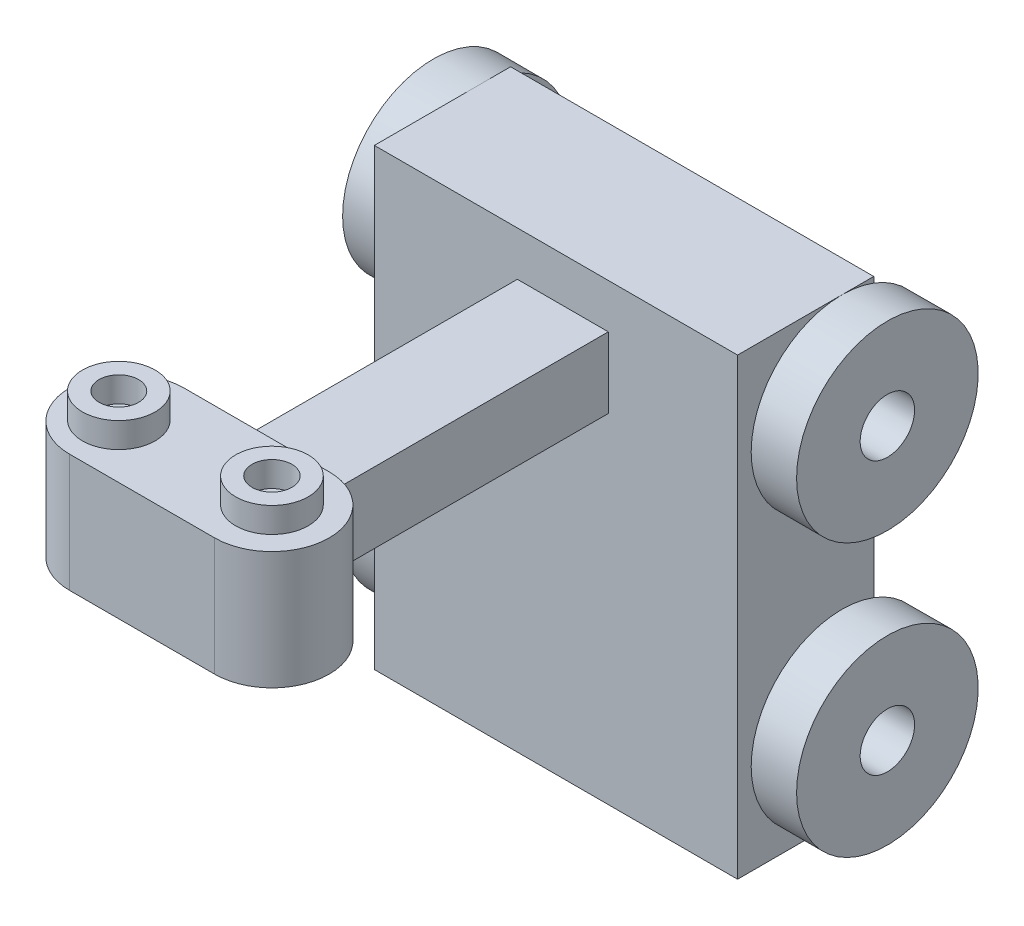
ISO-10303-21;
HEADER;
FILE_DESCRIPTION(('STEP AP214'),'2;1');
FILE_NAME('part.step','',(''),(''),'','','');
FILE_SCHEMA(('AUTOMOTIVE_DESIGN { 1 0 10303 214 1 1 1 1 }'));
ENDSEC;
DATA;
#1=APPLICATION_CONTEXT('core data for automotive mechanical design processes');
#2=APPLICATION_PROTOCOL_DEFINITION('international standard','automotive_design',2000,#1);
#3=PRODUCT_CONTEXT('',#1,'mechanical');
#4=PRODUCT('Part','Part','',(#3));
#5=PRODUCT_RELATED_PRODUCT_CATEGORY('part','',(#4));
#6=PRODUCT_DEFINITION_FORMATION('','',#4);
#7=PRODUCT_DEFINITION_CONTEXT('part definition',#1,'design');
#8=PRODUCT_DEFINITION('design','',#6,#7);
#9=PRODUCT_DEFINITION_SHAPE('','',#8);
#10=(LENGTH_UNIT() NAMED_UNIT(*) SI_UNIT(.MILLI.,.METRE.));
#11=(NAMED_UNIT(*) PLANE_ANGLE_UNIT() SI_UNIT($,.RADIAN.));
#12=(NAMED_UNIT(*) SI_UNIT($,.STERADIAN.) SOLID_ANGLE_UNIT());
#13=UNCERTAINTY_MEASURE_WITH_UNIT(LENGTH_MEASURE(1.E-05),#10,'distance_accuracy_value','');
#14=(GEOMETRIC_REPRESENTATION_CONTEXT(3) GLOBAL_UNCERTAINTY_ASSIGNED_CONTEXT((#13)) GLOBAL_UNIT_ASSIGNED_CONTEXT((#10,
#11,#12)) REPRESENTATION_CONTEXT('',''));
#15=CARTESIAN_POINT('',(0.,0.,0.));
#16=DIRECTION('',(0.,0.,1.));
#17=DIRECTION('',(1.,0.,0.));
#18=AXIS2_PLACEMENT_3D('',#15,#16,#17);
#19=CARTESIAN_POINT('',(0.,0.,1500.));
#20=DIRECTION('',(0.,0.,-1.));
#21=DIRECTION('',(-1.,0.,0.));
#22=AXIS2_PLACEMENT_3D('',#19,#20,#21);
#23=PLANE('',#22);
#24=DIRECTION('',(1.,0.,0.));
#25=VECTOR('',#24,1.);
#26=CARTESIAN_POINT('',(36898.7914533631,-2706.1111285181,1500.));
#27=LINE('',#26,#25);
#28=CARTESIAN_POINT('',(36898.7914533631,-2706.1111285181,1500.));
#29=VERTEX_POINT('',#28);
#30=CARTESIAN_POINT('',(40898.7914533631,-2706.1111285181,1500.));
#31=VERTEX_POINT('',#30);
#32=EDGE_CURVE('E340',#29,#31,#27,.T.);
#33=ORIENTED_EDGE('',*,*,#32,.T.);
#34=DIRECTION('',(0.,-1.,0.));
#35=VECTOR('',#34,1.);
#36=CARTESIAN_POINT('',(40898.7914533631,2293.8888714819,1500.));
#37=LINE('',#36,#35);
#38=CARTESIAN_POINT('',(40898.7914533631,2293.8888714819,1500.));
#39=VERTEX_POINT('',#38);
#40=EDGE_CURVE('E343',#39,#31,#37,.T.);
#41=ORIENTED_EDGE('',*,*,#40,.F.);
#42=DIRECTION('',(1.,0.,0.));
#43=VECTOR('',#42,1.);
#44=CARTESIAN_POINT('',(36898.7914533631,2293.8888714819,1500.));
#45=LINE('',#44,#43);
#46=CARTESIAN_POINT('',(36898.7914533631,2293.8888714819,1500.));
#47=VERTEX_POINT('',#46);
#48=EDGE_CURVE('E348',#47,#39,#45,.T.);
#49=ORIENTED_EDGE('',*,*,#48,.F.);
#50=DIRECTION('',(0.,-1.,0.));
#51=VECTOR('',#50,1.);
#52=CARTESIAN_POINT('',(36898.7914533631,2293.8888714819,1500.));
#53=LINE('',#52,#51);
#54=EDGE_CURVE('E352',#47,#29,#53,.T.);
#55=ORIENTED_EDGE('',*,*,#54,.T.);
#56=EDGE_LOOP('',(#33,#41,#49,#55));
#57=FACE_BOUND('',#56,.T.);
#58=DIRECTION('',(0.,-1.,0.));
#59=VECTOR('',#58,1.);
#60=CARTESIAN_POINT('',(38473.4254742559,1803.91212904851,1500.));
#61=LINE('',#60,#59);
#62=CARTESIAN_POINT('',(38473.4254742559,1803.91212904851,1500.));
#63=VERTEX_POINT('',#62);
#64=CARTESIAN_POINT('',(38473.4254742559,1024.7967765164,1500.));
#65=VERTEX_POINT('',#64);
#66=EDGE_CURVE('E242',#63,#65,#61,.T.);
#67=ORIENTED_EDGE('',*,*,#66,.F.);
#68=DIRECTION('',(-1.,0.,0.));
#69=VECTOR('',#68,1.);
#70=CARTESIAN_POINT('',(38473.4254742559,1803.91212904851,1500.));
#71=LINE('',#70,#69);
#72=CARTESIAN_POINT('',(39475.1452132258,1803.91212904851,1500.));
#73=VERTEX_POINT('',#72);
#74=EDGE_CURVE('E253',#73,#63,#71,.T.);
#75=ORIENTED_EDGE('',*,*,#74,.F.);
#76=DIRECTION('',(0.,1.,0.));
#77=VECTOR('',#76,1.);
#78=CARTESIAN_POINT('',(39475.1452132258,1803.91212904851,1500.));
#79=LINE('',#78,#77);
#80=CARTESIAN_POINT('',(39475.1452132258,1024.7967765164,1500.));
#81=VERTEX_POINT('',#80);
#82=EDGE_CURVE('E249',#81,#73,#79,.T.);
#83=ORIENTED_EDGE('',*,*,#82,.F.);
#84=DIRECTION('',(1.,0.,0.));
#85=VECTOR('',#84,1.);
#86=CARTESIAN_POINT('',(38473.4254742559,1024.7967765164,1500.));
#87=LINE('',#86,#85);
#88=EDGE_CURVE('E246',#65,#81,#87,.T.);
#89=ORIENTED_EDGE('',*,*,#88,.F.);
#90=EDGE_LOOP('',(#67,#75,#83,#89));
#91=FACE_BOUND('',#90,.T.);
#92=ADVANCED_FACE('F45',(#57,#91),#23,.F.);
#93=CARTESIAN_POINT('',(41398.7914533631,1293.8888714819,350.));
#94=DIRECTION('',(-1.,0.,0.));
#95=DIRECTION('',(0.,0.,1.));
#96=AXIS2_PLACEMENT_3D('',#93,#94,#95);
#97=CYLINDRICAL_SURFACE('',#96,1000.);
#98=CARTESIAN_POINT('',(41398.7914533631,1293.8888714819,350.));
#99=DIRECTION('',(-1.,0.,0.));
#100=DIRECTION('',(0.,0.,1.));
#101=AXIS2_PLACEMENT_3D('',#98,#99,#100);
#102=CIRCLE('',#101,1000.);
#103=CARTESIAN_POINT('',(41398.7914533631,1293.8888714819,1350.));
#104=VERTEX_POINT('',#103);
#105=EDGE_CURVE('E322',#104,#104,#102,.T.);
#106=ORIENTED_EDGE('',*,*,#105,.T.);
#107=EDGE_LOOP('',(#106));
#108=FACE_BOUND('',#107,.T.);
#109=CARTESIAN_POINT('',(40898.7914533631,1293.8888714819,350.));
#110=DIRECTION('',(1.,0.,0.));
#111=DIRECTION('',(0.,0.,-1.));
#112=AXIS2_PLACEMENT_3D('',#109,#110,#111);
#113=CIRCLE('',#112,1000.);
#114=CARTESIAN_POINT('',(40898.7914533631,2293.8888714819,350.));
#115=VERTEX_POINT('',#114);
#116=CARTESIAN_POINT('',(40898.7914533631,357.139171722141,0.));
#117=VERTEX_POINT('',#116);
#118=EDGE_CURVE('E329',#115,#117,#113,.T.);
#119=ORIENTED_EDGE('',*,*,#118,.T.);
#120=CARTESIAN_POINT('',(40898.7914533631,1293.8888714819,350.));
#121=DIRECTION('',(-1.,0.,0.));
#122=DIRECTION('',(0.,0.,1.));
#123=AXIS2_PLACEMENT_3D('',#120,#121,#122);
#124=CIRCLE('',#123,1000.);
#125=CARTESIAN_POINT('',(40898.7914533631,2230.63857124166,0.));
#126=VERTEX_POINT('',#125);
#127=EDGE_CURVE('E281',#117,#126,#124,.F.);
#128=ORIENTED_EDGE('',*,*,#127,.T.);
#129=EDGE_CURVE('E334',#126,#115,#113,.T.);
#130=ORIENTED_EDGE('',*,*,#129,.T.);
#131=EDGE_LOOP('',(#119,#128,#130));
#132=FACE_BOUND('',#131,.T.);
#133=ADVANCED_FACE('F447',(#108,#132),#97,.T.);
#134=CARTESIAN_POINT('',(36398.7914533631,1293.8888714819,350.));
#135=DIRECTION('',(-1.,0.,0.));
#136=DIRECTION('',(0.,0.,1.));
#137=AXIS2_PLACEMENT_3D('',#134,#135,#136);
#138=CIRCLE('',#137,1000.);
#139=CARTESIAN_POINT('',(36398.7914533631,1293.8888714819,1350.));
#140=VERTEX_POINT('',#139);
#141=EDGE_CURVE('E314',#140,#140,#138,.T.);
#142=ORIENTED_EDGE('',*,*,#141,.F.);
#143=EDGE_LOOP('',(#142));
#144=FACE_BOUND('',#143,.T.);
#145=CARTESIAN_POINT('',(36898.7914533631,1293.8888714819,350.));
#146=DIRECTION('',(1.,0.,0.));
#147=DIRECTION('',(0.,0.,-1.));
#148=AXIS2_PLACEMENT_3D('',#145,#146,#147);
#149=CIRCLE('',#148,1000.);
#150=CARTESIAN_POINT('',(36898.7914533631,2230.63857124166,0.));
#151=VERTEX_POINT('',#150);
#152=CARTESIAN_POINT('',(36898.7914533631,2293.8888714819,350.));
#153=VERTEX_POINT('',#152);
#154=EDGE_CURVE('E326',#151,#153,#149,.T.);
#155=ORIENTED_EDGE('',*,*,#154,.F.);
#156=CARTESIAN_POINT('',(36898.7914533631,1293.8888714819,350.));
#157=DIRECTION('',(1.,0.,0.));
#158=DIRECTION('',(0.,0.,-1.));
#159=AXIS2_PLACEMENT_3D('',#156,#157,#158);
#160=CIRCLE('',#159,1000.);
#161=CARTESIAN_POINT('',(36898.7914533631,357.139171722141,0.));
#162=VERTEX_POINT('',#161);
#163=EDGE_CURVE('E277',#151,#162,#160,.F.);
#164=ORIENTED_EDGE('',*,*,#163,.T.);
#165=EDGE_CURVE('E330',#153,#162,#149,.T.);
#166=ORIENTED_EDGE('',*,*,#165,.F.);
#167=EDGE_LOOP('',(#155,#164,#166));
#168=FACE_BOUND('',#167,.T.);
#169=ADVANCED_FACE('F453',(#144,#168),#97,.T.);
#170=CARTESIAN_POINT('',(41398.7914533631,-1706.1111285181,350.));
#171=DIRECTION('',(-1.,0.,0.));
#172=DIRECTION('',(0.,0.,1.));
#173=AXIS2_PLACEMENT_3D('',#170,#171,#172);
#174=CYLINDRICAL_SURFACE('',#173,1000.);
#175=CARTESIAN_POINT('',(41398.7914533631,-1706.1111285181,350.));
#176=DIRECTION('',(-1.,0.,0.));
#177=DIRECTION('',(0.,0.,1.));
#178=AXIS2_PLACEMENT_3D('',#175,#176,#177);
#179=CIRCLE('',#178,1000.);
#180=CARTESIAN_POINT('',(41398.7914533631,-1706.1111285181,1350.));
#181=VERTEX_POINT('',#180);
#182=EDGE_CURVE('E297',#181,#181,#179,.T.);
#183=ORIENTED_EDGE('',*,*,#182,.T.);
#184=EDGE_LOOP('',(#183));
#185=FACE_BOUND('',#184,.T.);
#186=CARTESIAN_POINT('',(40898.7914533631,-1706.1111285181,350.));
#187=DIRECTION('',(1.,0.,0.));
#188=DIRECTION('',(0.,0.,-1.));
#189=AXIS2_PLACEMENT_3D('',#186,#187,#188);
#190=CIRCLE('',#189,1000.);
#191=CARTESIAN_POINT('',(40898.7914533631,-2706.1111285181,350.));
#192=VERTEX_POINT('',#191);
#193=CARTESIAN_POINT('',(40898.7914533631,-2642.86082827786,0.));
#194=VERTEX_POINT('',#193);
#195=EDGE_CURVE('E301',#192,#194,#190,.T.);
#196=ORIENTED_EDGE('',*,*,#195,.T.);
#197=CARTESIAN_POINT('',(40898.7914533631,-1706.1111285181,350.));
#198=DIRECTION('',(-1.,0.,0.));
#199=DIRECTION('',(0.,0.,1.));
#200=AXIS2_PLACEMENT_3D('',#197,#198,#199);
#201=CIRCLE('',#200,1000.);
#202=CARTESIAN_POINT('',(40898.7914533631,-769.361428758339,0.));
#203=VERTEX_POINT('',#202);
#204=EDGE_CURVE('E410',#194,#203,#201,.F.);
#205=ORIENTED_EDGE('',*,*,#204,.T.);
#206=EDGE_CURVE('E305',#203,#192,#190,.T.);
#207=ORIENTED_EDGE('',*,*,#206,.T.);
#208=EDGE_LOOP('',(#196,#205,#207));
#209=FACE_BOUND('',#208,.T.);
#210=ADVANCED_FACE('F518',(#185,#209),#174,.T.);
#211=CARTESIAN_POINT('',(36398.7914533631,-1706.1111285181,350.));
#212=DIRECTION('',(-1.,0.,0.));
#213=DIRECTION('',(0.,0.,1.));
#214=AXIS2_PLACEMENT_3D('',#211,#212,#213);
#215=CIRCLE('',#214,1000.);
#216=CARTESIAN_POINT('',(36398.7914533631,-1706.1111285181,1350.));
#217=VERTEX_POINT('',#216);
#218=EDGE_CURVE('E289',#217,#217,#215,.T.);
#219=ORIENTED_EDGE('',*,*,#218,.F.);
#220=EDGE_LOOP('',(#219));
#221=FACE_BOUND('',#220,.T.);
#222=CARTESIAN_POINT('',(36898.7914533631,-1706.1111285181,350.));
#223=DIRECTION('',(1.,0.,0.));
#224=DIRECTION('',(0.,0.,-1.));
#225=AXIS2_PLACEMENT_3D('',#222,#223,#224);
#226=CIRCLE('',#225,1000.);
#227=CARTESIAN_POINT('',(36898.7914533631,-769.361428758339,0.));
#228=VERTEX_POINT('',#227);
#229=CARTESIAN_POINT('',(36898.7914533631,-2706.1111285181,350.));
#230=VERTEX_POINT('',#229);
#231=EDGE_CURVE('E401',#228,#230,#226,.T.);
#232=ORIENTED_EDGE('',*,*,#231,.F.);
#233=CARTESIAN_POINT('',(36898.7914533631,-1706.1111285181,350.));
#234=DIRECTION('',(1.,0.,0.));
#235=DIRECTION('',(0.,0.,-1.));
#236=AXIS2_PLACEMENT_3D('',#233,#234,#235);
#237=CIRCLE('',#236,1000.);
#238=CARTESIAN_POINT('',(36898.7914533631,-2642.86082827786,0.));
#239=VERTEX_POINT('',#238);
#240=EDGE_CURVE('E406',#228,#239,#237,.F.);
#241=ORIENTED_EDGE('',*,*,#240,.T.);
#242=EDGE_CURVE('E397',#230,#239,#226,.T.);
#243=ORIENTED_EDGE('',*,*,#242,.F.);
#244=EDGE_LOOP('',(#232,#241,#243));
#245=FACE_BOUND('',#244,.T.);
#246=ADVANCED_FACE('F513',(#221,#245),#174,.T.);
#247=CARTESIAN_POINT('',(40898.7914533631,2293.8888714819,1500.));
#248=DIRECTION('',(1.,0.,0.));
#249=DIRECTION('',(0.,0.,-1.));
#250=AXIS2_PLACEMENT_3D('',#247,#248,#249);
#251=PLANE('',#250);
#252=ORIENTED_EDGE('',*,*,#206,.F.);
#253=DIRECTION('',(0.,-1.,0.));
#254=VECTOR('',#253,1.);
#255=CARTESIAN_POINT('',(40898.7914533631,2293.8888714819,0.));
#256=LINE('',#255,#254);
#257=EDGE_CURVE('E365',#117,#203,#256,.T.);
#258=ORIENTED_EDGE('',*,*,#257,.F.);
#259=ORIENTED_EDGE('',*,*,#118,.F.);
#260=DIRECTION('',(0.,0.,-1.));
#261=VECTOR('',#260,1.);
#262=CARTESIAN_POINT('',(40898.7914533631,2293.8888714819,1500.));
#263=LINE('',#262,#261);
#264=EDGE_CURVE('E384',#39,#115,#263,.T.);
#265=ORIENTED_EDGE('',*,*,#264,.F.);
#266=ORIENTED_EDGE('',*,*,#40,.T.);
#267=DIRECTION('',(0.,0.,-1.));
#268=VECTOR('',#267,1.);
#269=CARTESIAN_POINT('',(40898.7914533631,-2706.1111285181,1500.));
#270=LINE('',#269,#268);
#271=EDGE_CURVE('E389',#31,#192,#270,.T.);
#272=ORIENTED_EDGE('',*,*,#271,.T.);
#273=EDGE_LOOP('',(#252,#258,#259,#265,#266,#272));
#274=FACE_BOUND('',#273,.T.);
#275=ADVANCED_FACE('F487',(#274),#251,.T.);
#276=CARTESIAN_POINT('',(36898.7914533631,2293.8888714819,1500.));
#277=DIRECTION('',(1.,0.,0.));
#278=DIRECTION('',(0.,0.,-1.));
#279=AXIS2_PLACEMENT_3D('',#276,#277,#278);
#280=PLANE('',#279);
#281=DIRECTION('',(0.,-1.,0.));
#282=VECTOR('',#281,1.);
#283=CARTESIAN_POINT('',(36898.7914533631,2293.8888714819,0.));
#284=LINE('',#283,#282);
#285=EDGE_CURVE('E373',#162,#228,#284,.T.);
#286=ORIENTED_EDGE('',*,*,#285,.T.);
#287=ORIENTED_EDGE('',*,*,#231,.T.);
#288=DIRECTION('',(0.,0.,-1.));
#289=VECTOR('',#288,1.);
#290=CARTESIAN_POINT('',(36898.7914533631,-2706.1111285181,1500.));
#291=LINE('',#290,#289);
#292=EDGE_CURVE('E374',#29,#230,#291,.T.);
#293=ORIENTED_EDGE('',*,*,#292,.F.);
#294=ORIENTED_EDGE('',*,*,#54,.F.);
#295=DIRECTION('',(0.,0.,-1.));
#296=VECTOR('',#295,1.);
#297=CARTESIAN_POINT('',(36898.7914533631,2293.8888714819,1500.));
#298=LINE('',#297,#296);
#299=EDGE_CURVE('E379',#47,#153,#298,.T.);
#300=ORIENTED_EDGE('',*,*,#299,.T.);
#301=ORIENTED_EDGE('',*,*,#165,.T.);
#302=EDGE_LOOP('',(#286,#287,#293,#294,#300,#301));
#303=FACE_BOUND('',#302,.T.);
#304=ADVANCED_FACE('F489',(#303),#280,.F.);
#305=ORIENTED_EDGE('',*,*,#129,.F.);
#306=CARTESIAN_POINT('',(40898.7914533631,2293.8888714819,0.));
#307=VERTEX_POINT('',#306);
#308=EDGE_CURVE('E360',#307,#126,#256,.T.);
#309=ORIENTED_EDGE('',*,*,#308,.F.);
#310=EDGE_CURVE('E383',#115,#307,#263,.T.);
#311=ORIENTED_EDGE('',*,*,#310,.F.);
#312=EDGE_LOOP('',(#305,#309,#311));
#313=FACE_BOUND('',#312,.T.);
#314=ADVANCED_FACE('F478',(#313),#251,.T.);
#315=CARTESIAN_POINT('',(36898.7914533631,2293.8888714819,0.));
#316=VERTEX_POINT('',#315);
#317=EDGE_CURVE('E344',#316,#151,#284,.T.);
#318=ORIENTED_EDGE('',*,*,#317,.T.);
#319=ORIENTED_EDGE('',*,*,#154,.T.);
#320=EDGE_CURVE('E378',#153,#316,#298,.T.);
#321=ORIENTED_EDGE('',*,*,#320,.T.);
#322=EDGE_LOOP('',(#318,#319,#321));
#323=FACE_BOUND('',#322,.T.);
#324=ADVANCED_FACE('F471',(#323),#280,.F.);
#325=CARTESIAN_POINT('',(36898.7914533631,-2706.1111285181,1500.));
#326=DIRECTION('',(0.,1.,0.));
#327=DIRECTION('',(0.,0.,1.));
#328=AXIS2_PLACEMENT_3D('',#325,#326,#327);
#329=PLANE('',#328);
#330=CARTESIAN_POINT('',(40898.7914533631,-2706.1111285181,0.));
#331=VERTEX_POINT('',#330);
#332=EDGE_CURVE('E388',#192,#331,#270,.T.);
#333=ORIENTED_EDGE('',*,*,#332,.F.);
#334=ORIENTED_EDGE('',*,*,#271,.F.);
#335=ORIENTED_EDGE('',*,*,#32,.F.);
#336=ORIENTED_EDGE('',*,*,#292,.T.);
#337=CARTESIAN_POINT('',(36898.7914533631,-2706.1111285181,0.));
#338=VERTEX_POINT('',#337);
#339=EDGE_CURVE('E355',#230,#338,#291,.T.);
#340=ORIENTED_EDGE('',*,*,#339,.T.);
#341=DIRECTION('',(1.,0.,0.));
#342=VECTOR('',#341,1.);
#343=CARTESIAN_POINT('',(36898.7914533631,-2706.1111285181,0.));
#344=LINE('',#343,#342);
#345=EDGE_CURVE('E339',#338,#331,#344,.T.);
#346=ORIENTED_EDGE('',*,*,#345,.T.);
#347=EDGE_LOOP('',(#333,#334,#335,#336,#340,#346));
#348=FACE_BOUND('',#347,.T.);
#349=ADVANCED_FACE('F47',(#348),#329,.F.);
#350=ORIENTED_EDGE('',*,*,#195,.F.);
#351=ORIENTED_EDGE('',*,*,#332,.T.);
#352=EDGE_CURVE('E359',#194,#331,#256,.T.);
#353=ORIENTED_EDGE('',*,*,#352,.F.);
#354=EDGE_LOOP('',(#350,#351,#353));
#355=FACE_BOUND('',#354,.T.);
#356=ADVANCED_FACE('F473',(#355),#251,.T.);
#357=CARTESIAN_POINT('',(36898.7914533631,2293.8888714819,1500.));
#358=DIRECTION('',(0.,1.,0.));
#359=DIRECTION('',(0.,0.,1.));
#360=AXIS2_PLACEMENT_3D('',#357,#358,#359);
#361=PLANE('',#360);
#362=ORIENTED_EDGE('',*,*,#320,.F.);
#363=ORIENTED_EDGE('',*,*,#299,.F.);
#364=ORIENTED_EDGE('',*,*,#48,.T.);
#365=ORIENTED_EDGE('',*,*,#264,.T.);
#366=ORIENTED_EDGE('',*,*,#310,.T.);
#367=DIRECTION('',(1.,0.,0.));
#368=VECTOR('',#367,1.);
#369=CARTESIAN_POINT('',(36898.7914533631,2293.8888714819,0.));
#370=LINE('',#369,#368);
#371=EDGE_CURVE('E364',#316,#307,#370,.T.);
#372=ORIENTED_EDGE('',*,*,#371,.F.);
#373=EDGE_LOOP('',(#362,#363,#364,#365,#366,#372));
#374=FACE_BOUND('',#373,.T.);
#375=ADVANCED_FACE('F468',(#374),#361,.T.);
#376=ORIENTED_EDGE('',*,*,#339,.F.);
#377=ORIENTED_EDGE('',*,*,#242,.T.);
#378=EDGE_CURVE('E369',#239,#338,#284,.T.);
#379=ORIENTED_EDGE('',*,*,#378,.T.);
#380=EDGE_LOOP('',(#376,#377,#379));
#381=FACE_BOUND('',#380,.T.);
#382=ADVANCED_FACE('F464',(#381),#280,.F.);
#383=CARTESIAN_POINT('',(0.,0.,0.));
#384=DIRECTION('',(0.,0.,-1.));
#385=DIRECTION('',(-1.,0.,0.));
#386=AXIS2_PLACEMENT_3D('',#383,#384,#385);
#387=PLANE('',#386);
#388=ORIENTED_EDGE('',*,*,#308,.T.);
#389=DIRECTION('',(0.,-1.,0.));
#390=VECTOR('',#389,1.);
#391=CARTESIAN_POINT('',(40898.7914533631,2293.8888714819,0.));
#392=LINE('',#391,#390);
#393=EDGE_CURVE('E272',#126,#117,#392,.T.);
#394=ORIENTED_EDGE('',*,*,#393,.T.);
#395=ORIENTED_EDGE('',*,*,#257,.T.);
#396=EDGE_CURVE('E268',#203,#194,#392,.T.);
#397=ORIENTED_EDGE('',*,*,#396,.T.);
#398=ORIENTED_EDGE('',*,*,#352,.T.);
#399=ORIENTED_EDGE('',*,*,#345,.F.);
#400=ORIENTED_EDGE('',*,*,#378,.F.);
#401=DIRECTION('',(0.,1.,0.));
#402=VECTOR('',#401,1.);
#403=CARTESIAN_POINT('',(36898.7914533631,2293.8888714819,0.));
#404=LINE('',#403,#402);
#405=EDGE_CURVE('E276',#239,#228,#404,.T.);
#406=ORIENTED_EDGE('',*,*,#405,.T.);
#407=ORIENTED_EDGE('',*,*,#285,.F.);
#408=EDGE_CURVE('E273',#162,#151,#404,.T.);
#409=ORIENTED_EDGE('',*,*,#408,.T.);
#410=ORIENTED_EDGE('',*,*,#317,.F.);
#411=ORIENTED_EDGE('',*,*,#371,.T.);
#412=EDGE_LOOP('',(#388,#394,#395,#397,#398,#399,#400,#406,#407,#409,#410,#411));
#413=FACE_BOUND('',#412,.T.);
#414=ADVANCED_FACE('F460',(#413),#387,.T.);
#415=CARTESIAN_POINT('',(41398.7914533631,1293.8888714819,350.));
#416=DIRECTION('',(-1.,0.,0.));
#417=DIRECTION('',(0.,0.,1.));
#418=AXIS2_PLACEMENT_3D('',#415,#416,#417);
#419=CYLINDRICAL_SURFACE('',#418,300.);
#420=CARTESIAN_POINT('',(36398.7914533631,1293.8888714819,350.));
#421=DIRECTION('',(-1.,0.,0.));
#422=DIRECTION('',(0.,0.,1.));
#423=AXIS2_PLACEMENT_3D('',#420,#421,#422);
#424=CIRCLE('',#423,300.);
#425=CARTESIAN_POINT('',(36398.7914533631,1293.8888714819,650.));
#426=VERTEX_POINT('',#425);
#427=EDGE_CURVE('E310',#426,#426,#424,.T.);
#428=ORIENTED_EDGE('',*,*,#427,.T.);
#429=EDGE_LOOP('',(#428));
#430=FACE_BOUND('',#429,.T.);
#431=CARTESIAN_POINT('',(36898.7914533631,1293.8888714819,350.));
#432=DIRECTION('',(1.,0.,0.));
#433=DIRECTION('',(0.,0.,-1.));
#434=AXIS2_PLACEMENT_3D('',#431,#432,#433);
#435=CIRCLE('',#434,300.);
#436=CARTESIAN_POINT('',(36898.7914533631,1293.8888714819,50.));
#437=VERTEX_POINT('',#436);
#438=EDGE_CURVE('E393',#437,#437,#435,.T.);
#439=ORIENTED_EDGE('',*,*,#438,.T.);
#440=EDGE_LOOP('',(#439));
#441=FACE_BOUND('',#440,.T.);
#442=ADVANCED_FACE('F463',(#430,#441),#419,.F.);
#443=CARTESIAN_POINT('',(40898.7914533631,1293.8888714819,350.));
#444=DIRECTION('',(1.,0.,0.));
#445=DIRECTION('',(0.,0.,-1.));
#446=AXIS2_PLACEMENT_3D('',#443,#444,#445);
#447=CIRCLE('',#446,300.);
#448=CARTESIAN_POINT('',(40898.7914533631,1293.8888714819,50.));
#449=VERTEX_POINT('',#448);
#450=EDGE_CURVE('E335',#449,#449,#447,.T.);
#451=ORIENTED_EDGE('',*,*,#450,.F.);
#452=EDGE_LOOP('',(#451));
#453=FACE_BOUND('',#452,.T.);
#454=CARTESIAN_POINT('',(41398.7914533631,1293.8888714819,350.));
#455=DIRECTION('',(-1.,0.,0.));
#456=DIRECTION('',(0.,0.,1.));
#457=AXIS2_PLACEMENT_3D('',#454,#455,#456);
#458=CIRCLE('',#457,300.);
#459=CARTESIAN_POINT('',(41398.7914533631,1293.8888714819,650.));
#460=VERTEX_POINT('',#459);
#461=EDGE_CURVE('E318',#460,#460,#458,.T.);
#462=ORIENTED_EDGE('',*,*,#461,.F.);
#463=EDGE_LOOP('',(#462));
#464=FACE_BOUND('',#463,.T.);
#465=ADVANCED_FACE('F459',(#453,#464),#419,.F.);
#466=CARTESIAN_POINT('',(41398.7914533631,0.,0.));
#467=DIRECTION('',(-1.,0.,0.));
#468=DIRECTION('',(0.,0.,1.));
#469=AXIS2_PLACEMENT_3D('',#466,#467,#468);
#470=PLANE('',#469);
#471=ORIENTED_EDGE('',*,*,#461,.T.);
#472=EDGE_LOOP('',(#471));
#473=FACE_BOUND('',#472,.T.);
#474=ORIENTED_EDGE('',*,*,#105,.F.);
#475=EDGE_LOOP('',(#474));
#476=FACE_BOUND('',#475,.T.);
#477=ADVANCED_FACE('F598',(#473,#476),#470,.F.);
#478=CARTESIAN_POINT('',(36398.7914533631,0.,0.));
#479=DIRECTION('',(-1.,0.,0.));
#480=DIRECTION('',(0.,0.,1.));
#481=AXIS2_PLACEMENT_3D('',#478,#479,#480);
#482=PLANE('',#481);
#483=ORIENTED_EDGE('',*,*,#427,.F.);
#484=EDGE_LOOP('',(#483));
#485=FACE_BOUND('',#484,.T.);
#486=ORIENTED_EDGE('',*,*,#141,.T.);
#487=EDGE_LOOP('',(#486));
#488=FACE_BOUND('',#487,.T.);
#489=ADVANCED_FACE('F510',(#485,#488),#482,.T.);
#490=ORIENTED_EDGE('',*,*,#438,.F.);
#491=EDGE_LOOP('',(#490));
#492=FACE_BOUND('',#491,.T.);
#493=ADVANCED_FACE('F497',(#492),#280,.F.);
#494=ORIENTED_EDGE('',*,*,#450,.T.);
#495=EDGE_LOOP('',(#494));
#496=FACE_BOUND('',#495,.T.);
#497=ADVANCED_FACE('F491',(#496),#251,.T.);
#498=CARTESIAN_POINT('',(41398.7914533631,-1706.1111285181,350.));
#499=DIRECTION('',(-1.,0.,0.));
#500=DIRECTION('',(0.,0.,1.));
#501=AXIS2_PLACEMENT_3D('',#498,#499,#500);
#502=CYLINDRICAL_SURFACE('',#501,300.);
#503=CARTESIAN_POINT('',(36398.7914533631,-1706.1111285181,350.));
#504=DIRECTION('',(-1.,0.,0.));
#505=DIRECTION('',(0.,0.,1.));
#506=AXIS2_PLACEMENT_3D('',#503,#504,#505);
#507=CIRCLE('',#506,300.);
#508=CARTESIAN_POINT('',(36398.7914533631,-1706.1111285181,650.));
#509=VERTEX_POINT('',#508);
#510=EDGE_CURVE('E285',#509,#509,#507,.T.);
#511=ORIENTED_EDGE('',*,*,#510,.T.);
#512=EDGE_LOOP('',(#511));
#513=FACE_BOUND('',#512,.T.);
#514=CARTESIAN_POINT('',(36898.7914533631,-1706.1111285181,350.));
#515=DIRECTION('',(1.,0.,0.));
#516=DIRECTION('',(0.,0.,-1.));
#517=AXIS2_PLACEMENT_3D('',#514,#515,#516);
#518=CIRCLE('',#517,300.);
#519=CARTESIAN_POINT('',(36898.7914533631,-1706.1111285181,50.));
#520=VERTEX_POINT('',#519);
#521=EDGE_CURVE('E402',#520,#520,#518,.T.);
#522=ORIENTED_EDGE('',*,*,#521,.T.);
#523=EDGE_LOOP('',(#522));
#524=FACE_BOUND('',#523,.T.);
#525=ADVANCED_FACE('F501',(#513,#524),#502,.F.);
#526=CARTESIAN_POINT('',(40898.7914533631,-1706.1111285181,350.));
#527=DIRECTION('',(1.,0.,0.));
#528=DIRECTION('',(0.,0.,-1.));
#529=AXIS2_PLACEMENT_3D('',#526,#527,#528);
#530=CIRCLE('',#529,300.);
#531=CARTESIAN_POINT('',(40898.7914533631,-1706.1111285181,50.));
#532=VERTEX_POINT('',#531);
#533=EDGE_CURVE('E306',#532,#532,#530,.T.);
#534=ORIENTED_EDGE('',*,*,#533,.F.);
#535=EDGE_LOOP('',(#534));
#536=FACE_BOUND('',#535,.T.);
#537=CARTESIAN_POINT('',(41398.7914533631,-1706.1111285181,350.));
#538=DIRECTION('',(-1.,0.,0.));
#539=DIRECTION('',(0.,0.,1.));
#540=AXIS2_PLACEMENT_3D('',#537,#538,#539);
#541=CIRCLE('',#540,300.);
#542=CARTESIAN_POINT('',(41398.7914533631,-1706.1111285181,650.));
#543=VERTEX_POINT('',#542);
#544=EDGE_CURVE('E293',#543,#543,#541,.T.);
#545=ORIENTED_EDGE('',*,*,#544,.F.);
#546=EDGE_LOOP('',(#545));
#547=FACE_BOUND('',#546,.T.);
#548=ADVANCED_FACE('F507',(#536,#547),#502,.F.);
#549=CARTESIAN_POINT('',(41398.7914533631,0.,0.));
#550=DIRECTION('',(-1.,0.,0.));
#551=DIRECTION('',(0.,0.,1.));
#552=AXIS2_PLACEMENT_3D('',#549,#550,#551);
#553=PLANE('',#552);
#554=ORIENTED_EDGE('',*,*,#544,.T.);
#555=EDGE_LOOP('',(#554));
#556=FACE_BOUND('',#555,.T.);
#557=ORIENTED_EDGE('',*,*,#182,.F.);
#558=EDGE_LOOP('',(#557));
#559=FACE_BOUND('',#558,.T.);
#560=ADVANCED_FACE('F587',(#556,#559),#553,.F.);
#561=CARTESIAN_POINT('',(36398.7914533631,0.,0.));
#562=DIRECTION('',(-1.,0.,0.));
#563=DIRECTION('',(0.,0.,1.));
#564=AXIS2_PLACEMENT_3D('',#561,#562,#563);
#565=PLANE('',#564);
#566=ORIENTED_EDGE('',*,*,#510,.F.);
#567=EDGE_LOOP('',(#566));
#568=FACE_BOUND('',#567,.T.);
#569=ORIENTED_EDGE('',*,*,#218,.T.);
#570=EDGE_LOOP('',(#569));
#571=FACE_BOUND('',#570,.T.);
#572=ADVANCED_FACE('F584',(#568,#571),#565,.T.);
#573=ORIENTED_EDGE('',*,*,#521,.F.);
#574=EDGE_LOOP('',(#573));
#575=FACE_BOUND('',#574,.T.);
#576=ADVANCED_FACE('F470',(#575),#280,.F.);
#577=ORIENTED_EDGE('',*,*,#533,.T.);
#578=EDGE_LOOP('',(#577));
#579=FACE_BOUND('',#578,.T.);
#580=ADVANCED_FACE('F477',(#579),#251,.T.);
#581=CARTESIAN_POINT('',(36898.7914533631,2293.8888714819,-2265.));
#582=DIRECTION('',(1.,0.,0.));
#583=DIRECTION('',(0.,0.,-1.));
#584=AXIS2_PLACEMENT_3D('',#581,#582,#583);
#585=PLANE('',#584);
#586=ORIENTED_EDGE('',*,*,#405,.F.);
#587=ORIENTED_EDGE('',*,*,#240,.F.);
#588=EDGE_LOOP('',(#586,#587));
#589=FACE_BOUND('',#588,.T.);
#590=ADVANCED_FACE('F485',(#589),#585,.T.);
#591=CARTESIAN_POINT('',(40898.7914533631,2293.8888714819,-2265.));
#592=DIRECTION('',(-1.,0.,0.));
#593=DIRECTION('',(0.,0.,1.));
#594=AXIS2_PLACEMENT_3D('',#591,#592,#593);
#595=PLANE('',#594);
#596=ORIENTED_EDGE('',*,*,#396,.F.);
#597=ORIENTED_EDGE('',*,*,#204,.F.);
#598=EDGE_LOOP('',(#596,#597));
#599=FACE_BOUND('',#598,.T.);
#600=ADVANCED_FACE('F572',(#599),#595,.T.);
#601=ORIENTED_EDGE('',*,*,#393,.F.);
#602=ORIENTED_EDGE('',*,*,#127,.F.);
#603=EDGE_LOOP('',(#601,#602));
#604=FACE_BOUND('',#603,.T.);
#605=ADVANCED_FACE('F569',(#604),#595,.T.);
#606=ORIENTED_EDGE('',*,*,#408,.F.);
#607=ORIENTED_EDGE('',*,*,#163,.F.);
#608=EDGE_LOOP('',(#606,#607));
#609=FACE_BOUND('',#608,.T.);
#610=ADVANCED_FACE('F571',(#609),#585,.T.);
#611=CARTESIAN_POINT('',(38473.4254742559,1803.91212904851,5503.));
#612=DIRECTION('',(1.,0.,0.));
#613=DIRECTION('',(0.,0.,-1.));
#614=AXIS2_PLACEMENT_3D('',#611,#612,#613);
#615=PLANE('',#614);
#616=DIRECTION('',(0.,0.,-1.));
#617=VECTOR('',#616,1.);
#618=CARTESIAN_POINT('',(38473.4254742559,1024.7967765164,5503.));
#619=LINE('',#618,#617);
#620=CARTESIAN_POINT('',(38473.4254742559,1024.7967765164,4872.51227754265));
#621=VERTEX_POINT('',#620);
#622=EDGE_CURVE('E69',#621,#65,#619,.T.);
#623=ORIENTED_EDGE('',*,*,#622,.F.);
#624=DIRECTION('',(0.,1.,0.));
#625=VECTOR('',#624,1.);
#626=CARTESIAN_POINT('',(38473.4254742559,1803.91212904851,4872.51227754265));
#627=LINE('',#626,#625);
#628=CARTESIAN_POINT('',(38473.4254742559,1803.91212904851,4872.51227754265));
#629=VERTEX_POINT('',#628);
#630=EDGE_CURVE('E238',#621,#629,#627,.T.);
#631=ORIENTED_EDGE('',*,*,#630,.T.);
#632=DIRECTION('',(0.,0.,-1.));
#633=VECTOR('',#632,1.);
#634=CARTESIAN_POINT('',(38473.4254742559,1803.91212904851,5503.));
#635=LINE('',#634,#633);
#636=EDGE_CURVE('E257',#629,#63,#635,.T.);
#637=ORIENTED_EDGE('',*,*,#636,.T.);
#638=ORIENTED_EDGE('',*,*,#66,.T.);
#639=EDGE_LOOP('',(#623,#631,#637,#638));
#640=FACE_BOUND('',#639,.T.);
#641=ADVANCED_FACE('F578',(#640),#615,.F.);
#642=CARTESIAN_POINT('',(38473.4254742559,1024.7967765164,5503.));
#643=DIRECTION('',(0.,1.,0.));
#644=DIRECTION('',(0.,0.,1.));
#645=AXIS2_PLACEMENT_3D('',#642,#643,#644);
#646=PLANE('',#645);
#647=DIRECTION('',(0.,0.,-1.));
#648=VECTOR('',#647,1.);
#649=CARTESIAN_POINT('',(39475.1452132258,1024.7967765164,5503.));
#650=LINE('',#649,#648);
#651=CARTESIAN_POINT('',(39475.1452132258,1024.7967765164,4872.51227754265));
#652=VERTEX_POINT('',#651);
#653=EDGE_CURVE('E263',#652,#81,#650,.T.);
#654=ORIENTED_EDGE('',*,*,#653,.F.);
#655=DIRECTION('',(-1.,0.,0.));
#656=VECTOR('',#655,1.);
#657=CARTESIAN_POINT('',(38473.4254742559,1024.7967765164,4872.51227754265));
#658=LINE('',#657,#656);
#659=EDGE_CURVE('E235',#652,#621,#658,.T.);
#660=ORIENTED_EDGE('',*,*,#659,.T.);
#661=ORIENTED_EDGE('',*,*,#622,.T.);
#662=ORIENTED_EDGE('',*,*,#88,.T.);
#663=EDGE_LOOP('',(#654,#660,#661,#662));
#664=FACE_BOUND('',#663,.T.);
#665=ADVANCED_FACE('F726',(#664),#646,.F.);
#666=CARTESIAN_POINT('',(39475.1452132258,1803.91212904851,5503.));
#667=DIRECTION('',(-1.,0.,0.));
#668=DIRECTION('',(0.,0.,1.));
#669=AXIS2_PLACEMENT_3D('',#666,#667,#668);
#670=PLANE('',#669);
#671=DIRECTION('',(0.,0.,-1.));
#672=VECTOR('',#671,1.);
#673=CARTESIAN_POINT('',(39475.1452132258,1803.91212904851,5503.));
#674=LINE('',#673,#672);
#675=CARTESIAN_POINT('',(39475.1452132258,1803.91212904851,4872.51227754265));
#676=VERTEX_POINT('',#675);
#677=EDGE_CURVE('E260',#676,#73,#674,.T.);
#678=ORIENTED_EDGE('',*,*,#677,.F.);
#679=DIRECTION('',(0.,-1.,0.));
#680=VECTOR('',#679,1.);
#681=CARTESIAN_POINT('',(39475.1452132258,1803.91212904851,4872.51227754265));
#682=LINE('',#681,#680);
#683=EDGE_CURVE('E61',#676,#652,#682,.T.);
#684=ORIENTED_EDGE('',*,*,#683,.T.);
#685=ORIENTED_EDGE('',*,*,#653,.T.);
#686=ORIENTED_EDGE('',*,*,#82,.T.);
#687=EDGE_LOOP('',(#678,#684,#685,#686));
#688=FACE_BOUND('',#687,.T.);
#689=ADVANCED_FACE('F735',(#688),#670,.F.);
#690=CARTESIAN_POINT('',(38473.4254742559,1803.91212904851,5503.));
#691=DIRECTION('',(0.,-1.,0.));
#692=DIRECTION('',(0.,0.,-1.));
#693=AXIS2_PLACEMENT_3D('',#690,#691,#692);
#694=PLANE('',#693);
#695=ORIENTED_EDGE('',*,*,#636,.F.);
#696=DIRECTION('',(1.,0.,0.));
#697=VECTOR('',#696,1.);
#698=CARTESIAN_POINT('',(38473.4254742559,1803.91212904851,4872.51227754265));
#699=LINE('',#698,#697);
#700=EDGE_CURVE('E414',#629,#676,#699,.T.);
#701=ORIENTED_EDGE('',*,*,#700,.T.);
#702=ORIENTED_EDGE('',*,*,#677,.T.);
#703=ORIENTED_EDGE('',*,*,#74,.T.);
#704=EDGE_LOOP('',(#695,#701,#702,#703));
#705=FACE_BOUND('',#704,.T.);
#706=ADVANCED_FACE('F745',(#705),#694,.F.);
#707=CARTESIAN_POINT('',(38175.0603054983,1003.91212904851,4872.51227754265));
#708=DIRECTION('',(0.,0.,-1.));
#709=DIRECTION('',(-1.,0.,0.));
#710=AXIS2_PLACEMENT_3D('',#707,#708,#709);
#711=PLANE('',#710);
#712=DIRECTION('',(0.,1.,0.));
#713=VECTOR('',#712,1.);
#714=CARTESIAN_POINT('',(38175.0603054983,1003.91212904851,4872.51227754265));
#715=LINE('',#714,#713);
#716=CARTESIAN_POINT('',(38175.0603054983,1003.91212904851,4872.51227754265));
#717=VERTEX_POINT('',#716);
#718=CARTESIAN_POINT('',(38175.0603054983,2303.91212904851,4872.51227754265));
#719=VERTEX_POINT('',#718);
#720=EDGE_CURVE('E225',#717,#719,#715,.T.);
#721=ORIENTED_EDGE('',*,*,#720,.T.);
#722=DIRECTION('',(-1.,0.,0.));
#723=VECTOR('',#722,1.);
#724=CARTESIAN_POINT('',(38175.0603054983,2303.91212904851,4872.51227754265));
#725=LINE('',#724,#723);
#726=CARTESIAN_POINT('',(39773.5103819834,2303.91212904851,4872.51227754265));
#727=VERTEX_POINT('',#726);
#728=EDGE_CURVE('E199',#727,#719,#725,.T.);
#729=ORIENTED_EDGE('',*,*,#728,.F.);
#730=DIRECTION('',(0.,1.,0.));
#731=VECTOR('',#730,1.);
#732=CARTESIAN_POINT('',(39773.5103819834,1003.91212904851,4872.51227754265));
#733=LINE('',#732,#731);
#734=CARTESIAN_POINT('',(39773.5103819834,1003.91212904851,4872.51227754265));
#735=VERTEX_POINT('',#734);
#736=EDGE_CURVE('E228',#735,#727,#733,.T.);
#737=ORIENTED_EDGE('',*,*,#736,.F.);
#738=DIRECTION('',(-1.,0.,0.));
#739=VECTOR('',#738,1.);
#740=CARTESIAN_POINT('',(38175.0603054983,1003.91212904851,4872.51227754265));
#741=LINE('',#740,#739);
#742=EDGE_CURVE('E185',#735,#717,#741,.T.);
#743=ORIENTED_EDGE('',*,*,#742,.T.);
#744=EDGE_LOOP('',(#721,#729,#737,#743));
#745=FACE_BOUND('',#744,.T.);
#746=ORIENTED_EDGE('',*,*,#630,.F.);
#747=ORIENTED_EDGE('',*,*,#659,.F.);
#748=ORIENTED_EDGE('',*,*,#683,.F.);
#749=ORIENTED_EDGE('',*,*,#700,.F.);
#750=EDGE_LOOP('',(#746,#747,#748,#749));
#751=FACE_BOUND('',#750,.T.);
#752=ADVANCED_FACE('F756',(#745,#751),#711,.T.);
#753=CARTESIAN_POINT('',(38175.0603054983,1003.91212904851,5503.));
#754=DIRECTION('',(0.,1.,0.));
#755=DIRECTION('',(0.,0.,1.));
#756=AXIS2_PLACEMENT_3D('',#753,#754,#755);
#757=CYLINDRICAL_SURFACE('',#756,630.487722457345);
#758=DIRECTION('',(0.,1.,0.));
#759=VECTOR('',#758,1.);
#760=CARTESIAN_POINT('',(38175.0603054983,1003.91212904851,6133.48772245734));
#761=LINE('',#760,#759);
#762=CARTESIAN_POINT('',(38175.0603054983,1003.91212904851,6133.48772245734));
#763=VERTEX_POINT('',#762);
#764=CARTESIAN_POINT('',(38175.0603054983,2303.91212904851,6133.48772245734));
#765=VERTEX_POINT('',#764);
#766=EDGE_CURVE('E173',#763,#765,#761,.T.);
#767=ORIENTED_EDGE('',*,*,#766,.T.);
#768=CARTESIAN_POINT('',(38175.0603054983,2303.91212904851,5503.));
#769=DIRECTION('',(0.,1.,0.));
#770=DIRECTION('',(0.,0.,1.));
#771=AXIS2_PLACEMENT_3D('',#768,#769,#770);
#772=CIRCLE('',#771,630.487722457345);
#773=EDGE_CURVE('E177',#719,#765,#772,.T.);
#774=ORIENTED_EDGE('',*,*,#773,.F.);
#775=ORIENTED_EDGE('',*,*,#720,.F.);
#776=CARTESIAN_POINT('',(38175.0603054983,1003.91212904851,5503.));
#777=DIRECTION('',(0.,1.,0.));
#778=DIRECTION('',(0.,0.,1.));
#779=AXIS2_PLACEMENT_3D('',#776,#777,#778);
#780=CIRCLE('',#779,630.487722457345);
#781=EDGE_CURVE('E179',#717,#763,#780,.T.);
#782=ORIENTED_EDGE('',*,*,#781,.T.);
#783=EDGE_LOOP('',(#767,#774,#775,#782));
#784=FACE_BOUND('',#783,.T.);
#785=ADVANCED_FACE('F175',(#784),#757,.T.);
#786=CARTESIAN_POINT('',(39773.5103819834,1003.91212904851,5503.));
#787=DIRECTION('',(0.,1.,0.));
#788=DIRECTION('',(0.,0.,1.));
#789=AXIS2_PLACEMENT_3D('',#786,#787,#788);
#790=CYLINDRICAL_SURFACE('',#789,630.487722457345);
#791=ORIENTED_EDGE('',*,*,#736,.T.);
#792=CARTESIAN_POINT('',(39773.5103819834,2303.91212904851,5503.));
#793=DIRECTION('',(0.,1.,0.));
#794=DIRECTION('',(0.,0.,1.));
#795=AXIS2_PLACEMENT_3D('',#792,#793,#794);
#796=CIRCLE('',#795,630.487722457345);
#797=CARTESIAN_POINT('',(39773.5103819834,2303.91212904851,6133.48772245734));
#798=VERTEX_POINT('',#797);
#799=EDGE_CURVE('E194',#798,#727,#796,.T.);
#800=ORIENTED_EDGE('',*,*,#799,.F.);
#801=DIRECTION('',(0.,1.,0.));
#802=VECTOR('',#801,1.);
#803=CARTESIAN_POINT('',(39773.5103819834,1003.91212904851,6133.48772245734));
#804=LINE('',#803,#802);
#805=CARTESIAN_POINT('',(39773.5103819834,1003.91212904851,6133.48772245734));
#806=VERTEX_POINT('',#805);
#807=EDGE_CURVE('E184',#806,#798,#804,.T.);
#808=ORIENTED_EDGE('',*,*,#807,.F.);
#809=CARTESIAN_POINT('',(39773.5103819834,1003.91212904851,5503.));
#810=DIRECTION('',(0.,1.,0.));
#811=DIRECTION('',(0.,0.,1.));
#812=AXIS2_PLACEMENT_3D('',#809,#810,#811);
#813=CIRCLE('',#812,630.487722457345);
#814=EDGE_CURVE('E218',#806,#735,#813,.T.);
#815=ORIENTED_EDGE('',*,*,#814,.T.);
#816=EDGE_LOOP('',(#791,#800,#808,#815));
#817=FACE_BOUND('',#816,.T.);
#818=ADVANCED_FACE('F777',(#817),#790,.T.);
#819=CARTESIAN_POINT('',(38175.0603054983,1003.91212904851,6133.48772245734));
#820=DIRECTION('',(0.,0.,1.));
#821=DIRECTION('',(1.,0.,0.));
#822=AXIS2_PLACEMENT_3D('',#819,#820,#821);
#823=PLANE('',#822);
#824=ORIENTED_EDGE('',*,*,#807,.T.);
#825=DIRECTION('',(1.,0.,0.));
#826=VECTOR('',#825,1.);
#827=CARTESIAN_POINT('',(38175.0603054983,2303.91212904851,6133.48772245734));
#828=LINE('',#827,#826);
#829=EDGE_CURVE('E188',#765,#798,#828,.T.);
#830=ORIENTED_EDGE('',*,*,#829,.F.);
#831=ORIENTED_EDGE('',*,*,#766,.F.);
#832=DIRECTION('',(1.,0.,0.));
#833=VECTOR('',#832,1.);
#834=CARTESIAN_POINT('',(38175.0603054983,1003.91212904851,6133.48772245734));
#835=LINE('',#834,#833);
#836=EDGE_CURVE('E215',#763,#806,#835,.T.);
#837=ORIENTED_EDGE('',*,*,#836,.T.);
#838=EDGE_LOOP('',(#824,#830,#831,#837));
#839=FACE_BOUND('',#838,.T.);
#840=ADVANCED_FACE('F189',(#839),#823,.T.);
#841=CARTESIAN_POINT('',(38175.0603054983,1003.91212904851,5503.));
#842=DIRECTION('',(0.,1.,0.));
#843=DIRECTION('',(0.,0.,1.));
#844=AXIS2_PLACEMENT_3D('',#841,#842,#843);
#845=PLANE('',#844);
#846=ORIENTED_EDGE('',*,*,#781,.F.);
#847=ORIENTED_EDGE('',*,*,#742,.F.);
#848=ORIENTED_EDGE('',*,*,#814,.F.);
#849=ORIENTED_EDGE('',*,*,#836,.F.);
#850=EDGE_LOOP('',(#846,#847,#848,#849));
#851=FACE_BOUND('',#850,.T.);
#852=ADVANCED_FACE('F441',(#851),#845,.F.);
#853=CARTESIAN_POINT('',(38175.0603054983,2303.91212904851,5503.));
#854=DIRECTION('',(0.,1.,0.));
#855=DIRECTION('',(0.,0.,1.));
#856=AXIS2_PLACEMENT_3D('',#853,#854,#855);
#857=PLANE('',#856);
#858=CARTESIAN_POINT('',(39773.5103819834,2303.91212904851,5503.));
#859=DIRECTION('',(0.,1.,0.));
#860=DIRECTION('',(0.,0.,1.));
#861=AXIS2_PLACEMENT_3D('',#858,#859,#860);
#862=CIRCLE('',#861,400.);
#863=CARTESIAN_POINT('',(39773.5103819834,2303.91212904851,5903.));
#864=VERTEX_POINT('',#863);
#865=EDGE_CURVE('E898',#864,#864,#862,.T.);
#866=ORIENTED_EDGE('',*,*,#865,.F.);
#867=EDGE_LOOP('',(#866));
#868=FACE_BOUND('',#867,.T.);
#869=CARTESIAN_POINT('',(38120.6841899587,2303.91212904851,5536.75576757154));
#870=DIRECTION('',(0.,1.,0.));
#871=DIRECTION('',(0.,0.,1.));
#872=AXIS2_PLACEMENT_3D('',#869,#870,#871);
#873=CIRCLE('',#872,400.);
#874=CARTESIAN_POINT('',(38120.6841899587,2303.91212904851,5936.75576757154));
#875=VERTEX_POINT('',#874);
#876=EDGE_CURVE('E205',#875,#875,#873,.T.);
#877=ORIENTED_EDGE('',*,*,#876,.F.);
#878=EDGE_LOOP('',(#877));
#879=FACE_BOUND('',#878,.T.);
#880=ORIENTED_EDGE('',*,*,#773,.T.);
#881=ORIENTED_EDGE('',*,*,#829,.T.);
#882=ORIENTED_EDGE('',*,*,#799,.T.);
#883=ORIENTED_EDGE('',*,*,#728,.T.);
#884=EDGE_LOOP('',(#880,#881,#882,#883));
#885=FACE_BOUND('',#884,.T.);
#886=ADVANCED_FACE('F197',(#868,#879,#885),#857,.T.);
#887=CARTESIAN_POINT('',(38120.6841899587,2580.91212904851,5536.75576757154));
#888=DIRECTION('',(0.,1.,0.));
#889=DIRECTION('',(0.,0.,1.));
#890=AXIS2_PLACEMENT_3D('',#887,#888,#889);
#891=PLANE('',#890);
#892=CARTESIAN_POINT('',(38120.6841899587,2580.91212904851,5536.75576757154));
#893=DIRECTION('',(0.,1.,0.));
#894=DIRECTION('',(0.,0.,1.));
#895=AXIS2_PLACEMENT_3D('',#892,#893,#894);
#896=CIRCLE('',#895,400.);
#897=CARTESIAN_POINT('',(38120.6841899587,2580.91212904851,5936.75576757154));
#898=VERTEX_POINT('',#897);
#899=EDGE_CURVE('E201',#898,#898,#896,.T.);
#900=ORIENTED_EDGE('',*,*,#899,.T.);
#901=EDGE_LOOP('',(#900));
#902=FACE_BOUND('',#901,.T.);
#903=CARTESIAN_POINT('',(38120.6841899587,2580.91212904851,5536.75576757154));
#904=DIRECTION('',(0.,1.,0.));
#905=DIRECTION('',(0.,0.,1.));
#906=AXIS2_PLACEMENT_3D('',#903,#904,#905);
#907=CIRCLE('',#906,217.789034684425);
#908=CARTESIAN_POINT('',(38120.6841899587,2580.91212904851,5754.54480225597));
#909=VERTEX_POINT('',#908);
#910=EDGE_CURVE('E897',#909,#909,#907,.T.);
#911=ORIENTED_EDGE('',*,*,#910,.F.);
#912=EDGE_LOOP('',(#911));
#913=FACE_BOUND('',#912,.T.);
#914=ADVANCED_FACE('F440',(#902,#913),#891,.T.);
#915=CARTESIAN_POINT('',(38120.6841899587,2580.91212904851,5536.75576757154));
#916=DIRECTION('',(0.,-1.,0.));
#917=DIRECTION('',(0.,0.,-1.));
#918=AXIS2_PLACEMENT_3D('',#915,#916,#917);
#919=CYLINDRICAL_SURFACE('',#918,400.);
#920=ORIENTED_EDGE('',*,*,#899,.F.);
#921=EDGE_LOOP('',(#920));
#922=FACE_BOUND('',#921,.T.);
#923=ORIENTED_EDGE('',*,*,#876,.T.);
#924=EDGE_LOOP('',(#923));
#925=FACE_BOUND('',#924,.T.);
#926=ADVANCED_FACE('F434',(#922,#925),#919,.T.);
#927=CARTESIAN_POINT('',(38120.6841899587,2580.91212904851,5536.75576757154));
#928=DIRECTION('',(0.,-1.,0.));
#929=DIRECTION('',(0.,0.,-1.));
#930=AXIS2_PLACEMENT_3D('',#927,#928,#929);
#931=CYLINDRICAL_SURFACE('',#930,217.789034684425);
#932=ORIENTED_EDGE('',*,*,#910,.T.);
#933=EDGE_LOOP('',(#932));
#934=FACE_BOUND('',#933,.T.);
#935=CARTESIAN_POINT('',(38120.6841899587,2303.91212904851,5536.75576757154));
#936=DIRECTION('',(0.,1.,0.));
#937=DIRECTION('',(0.,0.,1.));
#938=AXIS2_PLACEMENT_3D('',#935,#936,#937);
#939=CIRCLE('',#938,217.789034684425);
#940=CARTESIAN_POINT('',(38120.6841899587,2303.91212904851,5754.54480225597));
#941=VERTEX_POINT('',#940);
#942=EDGE_CURVE('E54',#941,#941,#939,.F.);
#943=ORIENTED_EDGE('',*,*,#942,.T.);
#944=EDGE_LOOP('',(#943));
#945=FACE_BOUND('',#944,.T.);
#946=ADVANCED_FACE('F420',(#934,#945),#931,.F.);
#947=ORIENTED_EDGE('',*,*,#942,.F.);
#948=EDGE_LOOP('',(#947));
#949=FACE_BOUND('',#948,.T.);
#950=ADVANCED_FACE('F422',(#949),#857,.T.);
#951=CARTESIAN_POINT('',(39773.5103819834,2580.91212904851,5503.));
#952=DIRECTION('',(0.,1.,0.));
#953=DIRECTION('',(0.,0.,1.));
#954=AXIS2_PLACEMENT_3D('',#951,#952,#953);
#955=PLANE('',#954);
#956=CARTESIAN_POINT('',(39773.5103819834,2580.91212904851,5503.));
#957=DIRECTION('',(0.,1.,0.));
#958=DIRECTION('',(0.,0.,1.));
#959=AXIS2_PLACEMENT_3D('',#956,#957,#958);
#960=CIRCLE('',#959,400.);
#961=CARTESIAN_POINT('',(39773.5103819834,2580.91212904851,5903.));
#962=VERTEX_POINT('',#961);
#963=EDGE_CURVE('E905',#962,#962,#960,.T.);
#964=ORIENTED_EDGE('',*,*,#963,.T.);
#965=EDGE_LOOP('',(#964));
#966=FACE_BOUND('',#965,.T.);
#967=CARTESIAN_POINT('',(39773.5103819834,2580.91212904851,5503.));
#968=DIRECTION('',(0.,1.,0.));
#969=DIRECTION('',(0.,0.,1.));
#970=AXIS2_PLACEMENT_3D('',#967,#968,#969);
#971=CIRCLE('',#970,219.999999999997);
#972=CARTESIAN_POINT('',(39773.5103819834,2580.91212904851,5723.));
#973=VERTEX_POINT('',#972);
#974=EDGE_CURVE('E893',#973,#973,#971,.T.);
#975=ORIENTED_EDGE('',*,*,#974,.F.);
#976=EDGE_LOOP('',(#975));
#977=FACE_BOUND('',#976,.T.);
#978=ADVANCED_FACE('F424',(#966,#977),#955,.T.);
#979=CARTESIAN_POINT('',(39773.5103819834,2580.91212904851,5503.));
#980=DIRECTION('',(0.,-1.,0.));
#981=DIRECTION('',(0.,0.,-1.));
#982=AXIS2_PLACEMENT_3D('',#979,#980,#981);
#983=CYLINDRICAL_SURFACE('',#982,400.);
#984=ORIENTED_EDGE('',*,*,#963,.F.);
#985=EDGE_LOOP('',(#984));
#986=FACE_BOUND('',#985,.T.);
#987=ORIENTED_EDGE('',*,*,#865,.T.);
#988=EDGE_LOOP('',(#987));
#989=FACE_BOUND('',#988,.T.);
#990=ADVANCED_FACE('F431',(#986,#989),#983,.T.);
#991=CARTESIAN_POINT('',(39773.5103819834,2580.91212904851,5503.));
#992=DIRECTION('',(0.,-1.,0.));
#993=DIRECTION('',(0.,0.,-1.));
#994=AXIS2_PLACEMENT_3D('',#991,#992,#993);
#995=CYLINDRICAL_SURFACE('',#994,219.999999999997);
#996=ORIENTED_EDGE('',*,*,#974,.T.);
#997=EDGE_LOOP('',(#996));
#998=FACE_BOUND('',#997,.T.);
#999=CARTESIAN_POINT('',(39773.5103819834,2303.91212904851,5503.));
#1000=DIRECTION('',(0.,1.,0.));
#1001=DIRECTION('',(0.,0.,1.));
#1002=AXIS2_PLACEMENT_3D('',#999,#1000,#1001);
#1003=CIRCLE('',#1002,219.999999999997);
#1004=CARTESIAN_POINT('',(39773.5103819834,2303.91212904851,5723.));
#1005=VERTEX_POINT('',#1004);
#1006=EDGE_CURVE('E11',#1005,#1005,#1003,.F.);
#1007=ORIENTED_EDGE('',*,*,#1006,.T.);
#1008=EDGE_LOOP('',(#1007));
#1009=FACE_BOUND('',#1008,.T.);
#1010=ADVANCED_FACE('F444',(#998,#1009),#995,.F.);
#1011=ORIENTED_EDGE('',*,*,#1006,.F.);
#1012=EDGE_LOOP('',(#1011));
#1013=FACE_BOUND('',#1012,.T.);
#1014=ADVANCED_FACE('F426',(#1013),#857,.T.);
#1015=CLOSED_SHELL('',(#92,#133,#169,#210,#246,#275,#304,#314,#324,#349,#356,#375,#382,#414,
#442,#465,#477,#489,#493,#497,#525,#548,#560,#572,#576,#580,#590,#600,#605,#610,#641,#665,#689,
#706,#752,#785,#818,#840,#852,#886,#914,#926,#946,#950,#978,#990,#1010,#1014));
#1016=MANIFOLD_SOLID_BREP('B2',#1015);
#1017=ADVANCED_BREP_SHAPE_REPRESENTATION('',(#18,#1016),#14);
#1018=SHAPE_DEFINITION_REPRESENTATION(#9,#1017);
ENDSEC;
END-ISO-10303-21;
